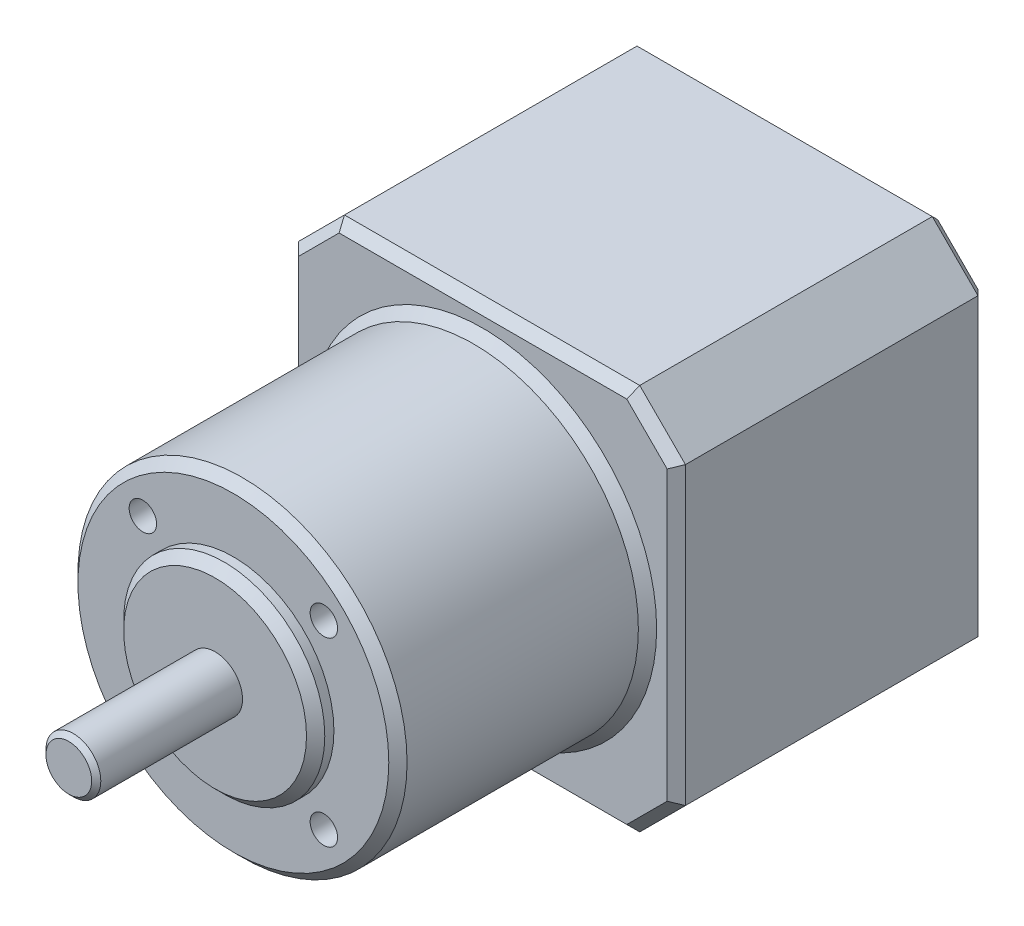
ISO-10303-21;
HEADER;
FILE_DESCRIPTION(('STEP AP214'),'2;1');
FILE_NAME('part.step','',(''),(''),'','','');
FILE_SCHEMA(('AUTOMOTIVE_DESIGN { 1 0 10303 214 1 1 1 1 }'));
ENDSEC;
DATA;
#1=APPLICATION_CONTEXT('core data for automotive mechanical design processes');
#2=APPLICATION_PROTOCOL_DEFINITION('international standard','automotive_design',2000,#1);
#3=PRODUCT_CONTEXT('',#1,'mechanical');
#4=PRODUCT('Part','Part','',(#3));
#5=PRODUCT_RELATED_PRODUCT_CATEGORY('part','',(#4));
#6=PRODUCT_DEFINITION_FORMATION('','',#4);
#7=PRODUCT_DEFINITION_CONTEXT('part definition',#1,'design');
#8=PRODUCT_DEFINITION('design','',#6,#7);
#9=PRODUCT_DEFINITION_SHAPE('','',#8);
#10=(LENGTH_UNIT() NAMED_UNIT(*) SI_UNIT(.MILLI.,.METRE.));
#11=(NAMED_UNIT(*) PLANE_ANGLE_UNIT() SI_UNIT($,.RADIAN.));
#12=(NAMED_UNIT(*) SI_UNIT($,.STERADIAN.) SOLID_ANGLE_UNIT());
#13=UNCERTAINTY_MEASURE_WITH_UNIT(LENGTH_MEASURE(1.E-05),#10,'distance_accuracy_value','');
#14=(GEOMETRIC_REPRESENTATION_CONTEXT(3) GLOBAL_UNCERTAINTY_ASSIGNED_CONTEXT((#13)) GLOBAL_UNIT_ASSIGNED_CONTEXT((#10,
#11,#12)) REPRESENTATION_CONTEXT('',''));
#15=CARTESIAN_POINT('',(0.,0.,0.));
#16=DIRECTION('',(0.,0.,1.));
#17=DIRECTION('',(1.,0.,0.));
#18=AXIS2_PLACEMENT_3D('',#15,#16,#17);
#19=CARTESIAN_POINT('',(21.15,21.15,34.));
#20=DIRECTION('',(-1.,0.,0.));
#21=DIRECTION('',(0.,0.,1.));
#22=AXIS2_PLACEMENT_3D('',#19,#20,#21);
#23=PLANE('',#22);
#24=DIRECTION('',(0.,0.,1.));
#25=VECTOR('',#24,1.);
#26=CARTESIAN_POINT('',(21.15,16.15,34.));
#27=LINE('',#26,#25);
#28=CARTESIAN_POINT('',(21.15,16.15,1.));
#29=VERTEX_POINT('',#28);
#30=CARTESIAN_POINT('',(21.15,16.15,33.));
#31=VERTEX_POINT('',#30);
#32=EDGE_CURVE('E444',#29,#31,#27,.T.);
#33=ORIENTED_EDGE('',*,*,#32,.T.);
#34=DIRECTION('',(0.,-1.,0.));
#35=VECTOR('',#34,1.);
#36=CARTESIAN_POINT('',(21.15,-16.15,33.));
#37=LINE('',#36,#35);
#38=CARTESIAN_POINT('',(21.15,-16.15,33.));
#39=VERTEX_POINT('',#38);
#40=EDGE_CURVE('E197',#31,#39,#37,.T.);
#41=ORIENTED_EDGE('',*,*,#40,.T.);
#42=DIRECTION('',(0.,0.,-1.));
#43=VECTOR('',#42,1.);
#44=CARTESIAN_POINT('',(21.15,-16.15,34.));
#45=LINE('',#44,#43);
#46=CARTESIAN_POINT('',(21.15,-16.15,1.));
#47=VERTEX_POINT('',#46);
#48=EDGE_CURVE('E421',#39,#47,#45,.T.);
#49=ORIENTED_EDGE('',*,*,#48,.T.);
#50=DIRECTION('',(0.,1.,0.));
#51=VECTOR('',#50,1.);
#52=CARTESIAN_POINT('',(21.15,21.15,1.));
#53=LINE('',#52,#51);
#54=EDGE_CURVE('E195',#47,#29,#53,.T.);
#55=ORIENTED_EDGE('',*,*,#54,.T.);
#56=EDGE_LOOP('',(#33,#41,#49,#55));
#57=FACE_BOUND('',#56,.T.);
#58=ADVANCED_FACE('F38',(#57),#23,.F.);
#59=CARTESIAN_POINT('',(-21.15,21.15,34.));
#60=DIRECTION('',(0.,-1.,0.));
#61=DIRECTION('',(0.,0.,-1.));
#62=AXIS2_PLACEMENT_3D('',#59,#60,#61);
#63=PLANE('',#62);
#64=DIRECTION('',(0.,0.,1.));
#65=VECTOR('',#64,1.);
#66=CARTESIAN_POINT('',(-16.15,21.15,34.));
#67=LINE('',#66,#65);
#68=CARTESIAN_POINT('',(-16.15,21.15,1.));
#69=VERTEX_POINT('',#68);
#70=CARTESIAN_POINT('',(-16.15,21.15,33.));
#71=VERTEX_POINT('',#70);
#72=EDGE_CURVE('E441',#69,#71,#67,.T.);
#73=ORIENTED_EDGE('',*,*,#72,.T.);
#74=DIRECTION('',(1.,0.,0.));
#75=VECTOR('',#74,1.);
#76=CARTESIAN_POINT('',(16.15,21.15,33.));
#77=LINE('',#76,#75);
#78=CARTESIAN_POINT('',(16.15,21.15,33.));
#79=VERTEX_POINT('',#78);
#80=EDGE_CURVE('E189',#71,#79,#77,.T.);
#81=ORIENTED_EDGE('',*,*,#80,.T.);
#82=DIRECTION('',(0.,0.,-1.));
#83=VECTOR('',#82,1.);
#84=CARTESIAN_POINT('',(16.15,21.15,34.));
#85=LINE('',#84,#83);
#86=CARTESIAN_POINT('',(16.15,21.15,1.));
#87=VERTEX_POINT('',#86);
#88=EDGE_CURVE('E438',#79,#87,#85,.T.);
#89=ORIENTED_EDGE('',*,*,#88,.T.);
#90=DIRECTION('',(-1.,0.,0.));
#91=VECTOR('',#90,1.);
#92=CARTESIAN_POINT('',(-21.15,21.15,1.));
#93=LINE('',#92,#91);
#94=EDGE_CURVE('E187',#87,#69,#93,.T.);
#95=ORIENTED_EDGE('',*,*,#94,.T.);
#96=EDGE_LOOP('',(#73,#81,#89,#95));
#97=FACE_BOUND('',#96,.T.);
#98=ADVANCED_FACE('F304',(#97),#63,.F.);
#99=CARTESIAN_POINT('',(-21.15,21.15,34.));
#100=DIRECTION('',(1.,0.,0.));
#101=DIRECTION('',(0.,1.,0.));
#102=AXIS2_PLACEMENT_3D('',#99,#100,#101);
#103=PLANE('',#102);
#104=DIRECTION('',(0.,0.,1.));
#105=VECTOR('',#104,1.);
#106=CARTESIAN_POINT('',(-21.15,-16.15,34.));
#107=LINE('',#106,#105);
#108=CARTESIAN_POINT('',(-21.15,-16.15,1.));
#109=VERTEX_POINT('',#108);
#110=CARTESIAN_POINT('',(-21.15,-16.15,33.));
#111=VERTEX_POINT('',#110);
#112=EDGE_CURVE('E435',#109,#111,#107,.T.);
#113=ORIENTED_EDGE('',*,*,#112,.T.);
#114=DIRECTION('',(0.,1.,0.));
#115=VECTOR('',#114,1.);
#116=CARTESIAN_POINT('',(-21.15,16.15,33.));
#117=LINE('',#116,#115);
#118=CARTESIAN_POINT('',(-21.15,16.15,33.));
#119=VERTEX_POINT('',#118);
#120=EDGE_CURVE('E214',#111,#119,#117,.T.);
#121=ORIENTED_EDGE('',*,*,#120,.T.);
#122=DIRECTION('',(0.,0.,-1.));
#123=VECTOR('',#122,1.);
#124=CARTESIAN_POINT('',(-21.15,16.15,34.));
#125=LINE('',#124,#123);
#126=CARTESIAN_POINT('',(-21.15,16.15,1.));
#127=VERTEX_POINT('',#126);
#128=EDGE_CURVE('E432',#119,#127,#125,.T.);
#129=ORIENTED_EDGE('',*,*,#128,.T.);
#130=DIRECTION('',(0.,-1.,0.));
#131=VECTOR('',#130,1.);
#132=CARTESIAN_POINT('',(-21.15,21.15,1.));
#133=LINE('',#132,#131);
#134=EDGE_CURVE('E212',#127,#109,#133,.T.);
#135=ORIENTED_EDGE('',*,*,#134,.T.);
#136=EDGE_LOOP('',(#113,#121,#129,#135));
#137=FACE_BOUND('',#136,.T.);
#138=ADVANCED_FACE('F310',(#137),#103,.F.);
#139=CARTESIAN_POINT('',(-21.15,-21.15,34.));
#140=DIRECTION('',(0.,1.,0.));
#141=DIRECTION('',(0.,0.,1.));
#142=AXIS2_PLACEMENT_3D('',#139,#140,#141);
#143=PLANE('',#142);
#144=DIRECTION('',(0.,0.,1.));
#145=VECTOR('',#144,1.);
#146=CARTESIAN_POINT('',(16.15,-21.15,34.));
#147=LINE('',#146,#145);
#148=CARTESIAN_POINT('',(16.15,-21.15,1.));
#149=VERTEX_POINT('',#148);
#150=CARTESIAN_POINT('',(16.15,-21.15,33.));
#151=VERTEX_POINT('',#150);
#152=EDGE_CURVE('E262',#149,#151,#147,.T.);
#153=ORIENTED_EDGE('',*,*,#152,.T.);
#154=DIRECTION('',(-1.,0.,0.));
#155=VECTOR('',#154,1.);
#156=CARTESIAN_POINT('',(-16.15,-21.15,33.));
#157=LINE('',#156,#155);
#158=CARTESIAN_POINT('',(-16.15,-21.15,33.));
#159=VERTEX_POINT('',#158);
#160=EDGE_CURVE('E206',#151,#159,#157,.T.);
#161=ORIENTED_EDGE('',*,*,#160,.T.);
#162=DIRECTION('',(0.,0.,-1.));
#163=VECTOR('',#162,1.);
#164=CARTESIAN_POINT('',(-16.15,-21.15,34.));
#165=LINE('',#164,#163);
#166=CARTESIAN_POINT('',(-16.15,-21.15,1.));
#167=VERTEX_POINT('',#166);
#168=EDGE_CURVE('E429',#159,#167,#165,.T.);
#169=ORIENTED_EDGE('',*,*,#168,.T.);
#170=DIRECTION('',(1.,0.,0.));
#171=VECTOR('',#170,1.);
#172=CARTESIAN_POINT('',(-21.15,-21.15,1.));
#173=LINE('',#172,#171);
#174=EDGE_CURVE('E204',#167,#149,#173,.T.);
#175=ORIENTED_EDGE('',*,*,#174,.T.);
#176=EDGE_LOOP('',(#153,#161,#169,#175));
#177=FACE_BOUND('',#176,.T.);
#178=ADVANCED_FACE('F482',(#177),#143,.F.);
#179=CARTESIAN_POINT('',(0.,0.,34.));
#180=DIRECTION('',(0.,0.,1.));
#181=DIRECTION('',(1.,0.,0.));
#182=AXIS2_PLACEMENT_3D('',#179,#180,#181);
#183=PLANE('',#182);
#184=DIRECTION('',(-1.,0.,0.));
#185=VECTOR('',#184,1.);
#186=CARTESIAN_POINT('',(-16.15,20.15,34.));
#187=LINE('',#186,#185);
#188=CARTESIAN_POINT('',(15.7357864376269,20.15,34.));
#189=VERTEX_POINT('',#188);
#190=CARTESIAN_POINT('',(-15.7357864376269,20.15,34.));
#191=VERTEX_POINT('',#190);
#192=EDGE_CURVE('E177',#189,#191,#187,.T.);
#193=ORIENTED_EDGE('',*,*,#192,.T.);
#194=DIRECTION('',(-0.707106781186549,-0.707106781186547,0.));
#195=VECTOR('',#194,1.);
#196=CARTESIAN_POINT('',(-17.9428932188134,17.9428932188135,34.));
#197=LINE('',#196,#195);
#198=CARTESIAN_POINT('',(-20.15,15.7357864376269,34.));
#199=VERTEX_POINT('',#198);
#200=EDGE_CURVE('E156',#191,#199,#197,.T.);
#201=ORIENTED_EDGE('',*,*,#200,.T.);
#202=DIRECTION('',(0.,-1.,0.));
#203=VECTOR('',#202,1.);
#204=CARTESIAN_POINT('',(-20.15,-16.15,34.));
#205=LINE('',#204,#203);
#206=CARTESIAN_POINT('',(-20.15,-15.7357864376269,34.));
#207=VERTEX_POINT('',#206);
#208=EDGE_CURVE('E165',#199,#207,#205,.T.);
#209=ORIENTED_EDGE('',*,*,#208,.T.);
#210=DIRECTION('',(0.707106781186546,-0.707106781186549,0.));
#211=VECTOR('',#210,1.);
#212=CARTESIAN_POINT('',(-17.9428932188135,-17.9428932188134,34.));
#213=LINE('',#212,#211);
#214=CARTESIAN_POINT('',(-15.7357864376269,-20.15,34.));
#215=VERTEX_POINT('',#214);
#216=EDGE_CURVE('E171',#207,#215,#213,.T.);
#217=ORIENTED_EDGE('',*,*,#216,.T.);
#218=DIRECTION('',(1.,0.,0.));
#219=VECTOR('',#218,1.);
#220=CARTESIAN_POINT('',(16.15,-20.15,34.));
#221=LINE('',#220,#219);
#222=CARTESIAN_POINT('',(15.7357864376269,-20.15,34.));
#223=VERTEX_POINT('',#222);
#224=EDGE_CURVE('E449',#215,#223,#221,.T.);
#225=ORIENTED_EDGE('',*,*,#224,.T.);
#226=DIRECTION('',(0.707106781186548,0.707106781186547,0.));
#227=VECTOR('',#226,1.);
#228=CARTESIAN_POINT('',(17.9428932188134,-17.9428932188135,34.));
#229=LINE('',#228,#227);
#230=CARTESIAN_POINT('',(20.15,-15.7357864376269,34.));
#231=VERTEX_POINT('',#230);
#232=EDGE_CURVE('E451',#223,#231,#229,.T.);
#233=ORIENTED_EDGE('',*,*,#232,.T.);
#234=DIRECTION('',(0.,1.,0.));
#235=VECTOR('',#234,1.);
#236=CARTESIAN_POINT('',(20.15,16.15,34.));
#237=LINE('',#236,#235);
#238=CARTESIAN_POINT('',(20.15,15.7357864376269,34.));
#239=VERTEX_POINT('',#238);
#240=EDGE_CURVE('E453',#231,#239,#237,.T.);
#241=ORIENTED_EDGE('',*,*,#240,.T.);
#242=DIRECTION('',(-0.707106781186547,0.707106781186549,0.));
#243=VECTOR('',#242,1.);
#244=CARTESIAN_POINT('',(17.9428932188135,17.9428932188134,34.));
#245=LINE('',#244,#243);
#246=EDGE_CURVE('E182',#239,#189,#245,.T.);
#247=ORIENTED_EDGE('',*,*,#246,.T.);
#248=EDGE_LOOP('',(#193,#201,#209,#217,#225,#233,#241,#247));
#249=FACE_BOUND('',#248,.T.);
#250=CARTESIAN_POINT('',(0.,0.,34.));
#251=DIRECTION('',(0.,0.,1.));
#252=DIRECTION('',(1.,0.,0.));
#253=AXIS2_PLACEMENT_3D('',#250,#251,#252);
#254=CIRCLE('',#253,19.);
#255=CARTESIAN_POINT('',(19.,0.,34.));
#256=VERTEX_POINT('',#255);
#257=EDGE_CURVE('E172',#256,#256,#254,.F.);
#258=ORIENTED_EDGE('',*,*,#257,.T.);
#259=EDGE_LOOP('',(#258));
#260=FACE_BOUND('',#259,.T.);
#261=ADVANCED_FACE('F174',(#249,#260),#183,.T.);
#262=CARTESIAN_POINT('',(0.,0.,0.));
#263=DIRECTION('',(0.,0.,1.));
#264=DIRECTION('',(1.,0.,0.));
#265=AXIS2_PLACEMENT_3D('',#262,#263,#264);
#266=PLANE('',#265);
#267=DIRECTION('',(0.,-1.,0.));
#268=VECTOR('',#267,1.);
#269=CARTESIAN_POINT('',(20.15,0.,0.));
#270=LINE('',#269,#268);
#271=CARTESIAN_POINT('',(20.15,15.7357864376269,0.));
#272=VERTEX_POINT('',#271);
#273=CARTESIAN_POINT('',(20.15,-15.7357864376269,0.));
#274=VERTEX_POINT('',#273);
#275=EDGE_CURVE('E53',#272,#274,#270,.T.);
#276=ORIENTED_EDGE('',*,*,#275,.T.);
#277=DIRECTION('',(-0.707106781186548,-0.707106781186547,0.));
#278=VECTOR('',#277,1.);
#279=CARTESIAN_POINT('',(15.4428932188134,-20.4428932188134,0.));
#280=LINE('',#279,#278);
#281=CARTESIAN_POINT('',(15.7357864376269,-20.15,0.));
#282=VERTEX_POINT('',#281);
#283=EDGE_CURVE('E234',#274,#282,#280,.T.);
#284=ORIENTED_EDGE('',*,*,#283,.T.);
#285=DIRECTION('',(-1.,0.,0.));
#286=VECTOR('',#285,1.);
#287=CARTESIAN_POINT('',(0.,-20.15,0.));
#288=LINE('',#287,#286);
#289=CARTESIAN_POINT('',(-15.7357864376269,-20.15,0.));
#290=VERTEX_POINT('',#289);
#291=EDGE_CURVE('E222',#282,#290,#288,.T.);
#292=ORIENTED_EDGE('',*,*,#291,.T.);
#293=DIRECTION('',(-0.707106781186546,0.707106781186549,0.));
#294=VECTOR('',#293,1.);
#295=CARTESIAN_POINT('',(-20.4428932188134,-15.4428932188134,0.));
#296=LINE('',#295,#294);
#297=CARTESIAN_POINT('',(-20.15,-15.7357864376269,0.));
#298=VERTEX_POINT('',#297);
#299=EDGE_CURVE('E224',#290,#298,#296,.T.);
#300=ORIENTED_EDGE('',*,*,#299,.T.);
#301=DIRECTION('',(0.,1.,0.));
#302=VECTOR('',#301,1.);
#303=CARTESIAN_POINT('',(-20.15,0.,0.));
#304=LINE('',#303,#302);
#305=CARTESIAN_POINT('',(-20.15,15.7357864376269,0.));
#306=VERTEX_POINT('',#305);
#307=EDGE_CURVE('E226',#298,#306,#304,.T.);
#308=ORIENTED_EDGE('',*,*,#307,.T.);
#309=DIRECTION('',(0.707106781186549,0.707106781186547,0.));
#310=VECTOR('',#309,1.);
#311=CARTESIAN_POINT('',(-15.4428932188134,20.4428932188134,0.));
#312=LINE('',#311,#310);
#313=CARTESIAN_POINT('',(-15.7357864376269,20.15,0.));
#314=VERTEX_POINT('',#313);
#315=EDGE_CURVE('E228',#306,#314,#312,.T.);
#316=ORIENTED_EDGE('',*,*,#315,.T.);
#317=DIRECTION('',(1.,0.,0.));
#318=VECTOR('',#317,1.);
#319=CARTESIAN_POINT('',(0.,20.15,0.));
#320=LINE('',#319,#318);
#321=CARTESIAN_POINT('',(15.7357864376269,20.15,0.));
#322=VERTEX_POINT('',#321);
#323=EDGE_CURVE('E230',#314,#322,#320,.T.);
#324=ORIENTED_EDGE('',*,*,#323,.T.);
#325=DIRECTION('',(0.707106781186547,-0.707106781186549,0.));
#326=VECTOR('',#325,1.);
#327=CARTESIAN_POINT('',(20.4428932188134,15.4428932188134,0.));
#328=LINE('',#327,#326);
#329=EDGE_CURVE('E58',#322,#272,#328,.T.);
#330=ORIENTED_EDGE('',*,*,#329,.T.);
#331=EDGE_LOOP('',(#276,#284,#292,#300,#308,#316,#324,#330));
#332=FACE_BOUND('',#331,.T.);
#333=ADVANCED_FACE('F320',(#332),#266,.F.);
#334=CARTESIAN_POINT('',(-16.15,-21.15,34.));
#335=DIRECTION('',(0.707106781186549,0.707106781186546,0.));
#336=DIRECTION('',(0.,0.,-1.));
#337=AXIS2_PLACEMENT_3D('',#334,#335,#336);
#338=PLANE('',#337);
#339=ORIENTED_EDGE('',*,*,#168,.F.);
#340=DIRECTION('',(0.707106781186546,-0.707106781186549,0.));
#341=VECTOR('',#340,1.);
#342=CARTESIAN_POINT('',(-16.15,-21.15,33.));
#343=LINE('',#342,#341);
#344=EDGE_CURVE('E210',#159,#111,#343,.F.);
#345=ORIENTED_EDGE('',*,*,#344,.T.);
#346=ORIENTED_EDGE('',*,*,#112,.F.);
#347=DIRECTION('',(-0.707106781186546,0.707106781186549,0.));
#348=VECTOR('',#347,1.);
#349=CARTESIAN_POINT('',(-16.15,-21.15,1.));
#350=LINE('',#349,#348);
#351=EDGE_CURVE('E208',#109,#167,#350,.F.);
#352=ORIENTED_EDGE('',*,*,#351,.T.);
#353=EDGE_LOOP('',(#339,#345,#346,#352));
#354=FACE_BOUND('',#353,.T.);
#355=ADVANCED_FACE('F316',(#354),#338,.F.);
#356=CARTESIAN_POINT('',(-21.15,16.15,34.));
#357=DIRECTION('',(0.707106781186547,-0.707106781186549,0.));
#358=DIRECTION('',(0.,0.,-1.));
#359=AXIS2_PLACEMENT_3D('',#356,#357,#358);
#360=PLANE('',#359);
#361=ORIENTED_EDGE('',*,*,#128,.F.);
#362=DIRECTION('',(-0.707106781186549,-0.707106781186547,0.));
#363=VECTOR('',#362,1.);
#364=CARTESIAN_POINT('',(-21.15,16.15,33.));
#365=LINE('',#364,#363);
#366=EDGE_CURVE('E158',#119,#71,#365,.F.);
#367=ORIENTED_EDGE('',*,*,#366,.T.);
#368=ORIENTED_EDGE('',*,*,#72,.F.);
#369=DIRECTION('',(0.707106781186549,0.707106781186547,0.));
#370=VECTOR('',#369,1.);
#371=CARTESIAN_POINT('',(-21.15,16.15,1.));
#372=LINE('',#371,#370);
#373=EDGE_CURVE('E179',#69,#127,#372,.F.);
#374=ORIENTED_EDGE('',*,*,#373,.T.);
#375=EDGE_LOOP('',(#361,#367,#368,#374));
#376=FACE_BOUND('',#375,.T.);
#377=ADVANCED_FACE('F319',(#376),#360,.F.);
#378=CARTESIAN_POINT('',(21.15,-16.15,34.));
#379=DIRECTION('',(-0.707106781186547,0.707106781186548,0.));
#380=DIRECTION('',(0.,0.,-1.));
#381=AXIS2_PLACEMENT_3D('',#378,#379,#380);
#382=PLANE('',#381);
#383=ORIENTED_EDGE('',*,*,#48,.F.);
#384=DIRECTION('',(0.707106781186548,0.707106781186547,0.));
#385=VECTOR('',#384,1.);
#386=CARTESIAN_POINT('',(21.15,-16.15,33.));
#387=LINE('',#386,#385);
#388=EDGE_CURVE('E202',#39,#151,#387,.F.);
#389=ORIENTED_EDGE('',*,*,#388,.T.);
#390=ORIENTED_EDGE('',*,*,#152,.F.);
#391=DIRECTION('',(-0.707106781186548,-0.707106781186547,0.));
#392=VECTOR('',#391,1.);
#393=CARTESIAN_POINT('',(21.15,-16.15,1.));
#394=LINE('',#393,#392);
#395=EDGE_CURVE('E199',#149,#47,#394,.F.);
#396=ORIENTED_EDGE('',*,*,#395,.T.);
#397=EDGE_LOOP('',(#383,#389,#390,#396));
#398=FACE_BOUND('',#397,.T.);
#399=ADVANCED_FACE('F324',(#398),#382,.F.);
#400=CARTESIAN_POINT('',(16.15,21.15,34.));
#401=DIRECTION('',(-0.707106781186549,-0.707106781186547,0.));
#402=DIRECTION('',(0.,0.,-1.));
#403=AXIS2_PLACEMENT_3D('',#400,#401,#402);
#404=PLANE('',#403);
#405=ORIENTED_EDGE('',*,*,#88,.F.);
#406=DIRECTION('',(-0.707106781186547,0.707106781186549,0.));
#407=VECTOR('',#406,1.);
#408=CARTESIAN_POINT('',(16.15,21.15,33.));
#409=LINE('',#408,#407);
#410=EDGE_CURVE('E193',#79,#31,#409,.F.);
#411=ORIENTED_EDGE('',*,*,#410,.T.);
#412=ORIENTED_EDGE('',*,*,#32,.F.);
#413=DIRECTION('',(0.707106781186547,-0.707106781186549,0.));
#414=VECTOR('',#413,1.);
#415=CARTESIAN_POINT('',(16.15,21.15,1.));
#416=LINE('',#415,#414);
#417=EDGE_CURVE('E191',#29,#87,#416,.F.);
#418=ORIENTED_EDGE('',*,*,#417,.T.);
#419=EDGE_LOOP('',(#405,#411,#412,#418));
#420=FACE_BOUND('',#419,.T.);
#421=ADVANCED_FACE('F328',(#420),#404,.F.);
#422=CARTESIAN_POINT('',(0.,0.,61.3));
#423=DIRECTION('',(0.,0.,-1.));
#424=DIRECTION('',(-1.,0.,0.));
#425=AXIS2_PLACEMENT_3D('',#422,#423,#424);
#426=CYLINDRICAL_SURFACE('',#425,18.);
#427=CARTESIAN_POINT('',(0.,0.,35.));
#428=DIRECTION('',(0.,0.,1.));
#429=DIRECTION('',(1.,0.,0.));
#430=AXIS2_PLACEMENT_3D('',#427,#428,#429);
#431=CIRCLE('',#430,18.);
#432=CARTESIAN_POINT('',(18.,0.,35.));
#433=VERTEX_POINT('',#432);
#434=EDGE_CURVE('E219',#433,#433,#431,.T.);
#435=ORIENTED_EDGE('',*,*,#434,.T.);
#436=EDGE_LOOP('',(#435));
#437=FACE_BOUND('',#436,.T.);
#438=CARTESIAN_POINT('',(0.,0.,60.3));
#439=DIRECTION('',(0.,0.,1.));
#440=DIRECTION('',(1.,0.,0.));
#441=AXIS2_PLACEMENT_3D('',#438,#439,#440);
#442=CIRCLE('',#441,18.);
#443=CARTESIAN_POINT('',(18.,0.,60.3));
#444=VERTEX_POINT('',#443);
#445=EDGE_CURVE('E216',#444,#444,#442,.F.);
#446=ORIENTED_EDGE('',*,*,#445,.T.);
#447=EDGE_LOOP('',(#446));
#448=FACE_BOUND('',#447,.T.);
#449=ADVANCED_FACE('F332',(#437,#448),#426,.T.);
#450=CARTESIAN_POINT('',(0.,0.,61.3));
#451=DIRECTION('',(0.,0.,1.));
#452=DIRECTION('',(1.,0.,0.));
#453=AXIS2_PLACEMENT_3D('',#450,#451,#452);
#454=PLANE('',#453);
#455=CARTESIAN_POINT('',(-9.89949493661158,9.89949493661175,61.3));
#456=DIRECTION('',(0.,0.,1.));
#457=DIRECTION('',(1.,0.,0.));
#458=AXIS2_PLACEMENT_3D('',#455,#456,#457);
#459=CIRCLE('',#458,1.5);
#460=CARTESIAN_POINT('',(-8.39949493661158,9.89949493661175,61.3));
#461=VERTEX_POINT('',#460);
#462=EDGE_CURVE('E571',#461,#461,#459,.T.);
#463=ORIENTED_EDGE('',*,*,#462,.F.);
#464=EDGE_LOOP('',(#463));
#465=FACE_BOUND('',#464,.T.);
#466=CARTESIAN_POINT('',(-9.89949493661172,-9.89949493661161,61.3));
#467=DIRECTION('',(0.,0.,1.));
#468=DIRECTION('',(1.,0.,0.));
#469=AXIS2_PLACEMENT_3D('',#466,#467,#468);
#470=CIRCLE('',#469,1.5);
#471=CARTESIAN_POINT('',(-8.39949493661172,-9.89949493661161,61.3));
#472=VERTEX_POINT('',#471);
#473=EDGE_CURVE('E565',#472,#472,#470,.T.);
#474=ORIENTED_EDGE('',*,*,#473,.F.);
#475=EDGE_LOOP('',(#474));
#476=FACE_BOUND('',#475,.T.);
#477=CARTESIAN_POINT('',(9.89949493661165,-9.89949493661168,61.3));
#478=DIRECTION('',(0.,0.,1.));
#479=DIRECTION('',(1.,0.,0.));
#480=AXIS2_PLACEMENT_3D('',#477,#478,#479);
#481=CIRCLE('',#480,1.5);
#482=CARTESIAN_POINT('',(11.3994949366116,-9.89949493661168,61.3));
#483=VERTEX_POINT('',#482);
#484=EDGE_CURVE('E556',#483,#483,#481,.T.);
#485=ORIENTED_EDGE('',*,*,#484,.F.);
#486=EDGE_LOOP('',(#485));
#487=FACE_BOUND('',#486,.T.);
#488=CARTESIAN_POINT('',(9.89949493661165,9.89949493661168,61.3));
#489=DIRECTION('',(0.,0.,1.));
#490=DIRECTION('',(1.,0.,0.));
#491=AXIS2_PLACEMENT_3D('',#488,#489,#490);
#492=CIRCLE('',#491,1.5);
#493=CARTESIAN_POINT('',(11.3994949366116,9.89949493661168,61.3));
#494=VERTEX_POINT('',#493);
#495=EDGE_CURVE('E424',#494,#494,#492,.T.);
#496=ORIENTED_EDGE('',*,*,#495,.F.);
#497=EDGE_LOOP('',(#496));
#498=FACE_BOUND('',#497,.T.);
#499=CARTESIAN_POINT('',(0.,0.,61.3));
#500=DIRECTION('',(0.,0.,1.));
#501=DIRECTION('',(1.,0.,0.));
#502=AXIS2_PLACEMENT_3D('',#499,#500,#501);
#503=CIRCLE('',#502,17.);
#504=CARTESIAN_POINT('',(17.,0.,61.3));
#505=VERTEX_POINT('',#504);
#506=EDGE_CURVE('E242',#505,#505,#503,.T.);
#507=ORIENTED_EDGE('',*,*,#506,.T.);
#508=EDGE_LOOP('',(#507));
#509=FACE_BOUND('',#508,.T.);
#510=CARTESIAN_POINT('',(0.,0.,61.3));
#511=DIRECTION('',(0.,0.,1.));
#512=DIRECTION('',(1.,0.,0.));
#513=AXIS2_PLACEMENT_3D('',#510,#511,#512);
#514=CIRCLE('',#513,11.);
#515=CARTESIAN_POINT('',(11.,0.,61.3));
#516=VERTEX_POINT('',#515);
#517=EDGE_CURVE('E416',#516,#516,#514,.T.);
#518=ORIENTED_EDGE('',*,*,#517,.F.);
#519=EDGE_LOOP('',(#518));
#520=FACE_BOUND('',#519,.T.);
#521=ADVANCED_FACE('F512',(#465,#476,#487,#498,#509,#520),#454,.T.);
#522=CARTESIAN_POINT('',(0.,0.,63.3));
#523=DIRECTION('',(0.,0.,-1.));
#524=DIRECTION('',(-1.,0.,0.));
#525=AXIS2_PLACEMENT_3D('',#522,#523,#524);
#526=CYLINDRICAL_SURFACE('',#525,11.);
#527=CARTESIAN_POINT('',(0.,0.,62.3));
#528=DIRECTION('',(0.,0.,1.));
#529=DIRECTION('',(1.,0.,0.));
#530=AXIS2_PLACEMENT_3D('',#527,#528,#529);
#531=CIRCLE('',#530,11.);
#532=CARTESIAN_POINT('',(11.,0.,62.3));
#533=VERTEX_POINT('',#532);
#534=EDGE_CURVE('E239',#533,#533,#531,.F.);
#535=ORIENTED_EDGE('',*,*,#534,.T.);
#536=EDGE_LOOP('',(#535));
#537=FACE_BOUND('',#536,.T.);
#538=ORIENTED_EDGE('',*,*,#517,.T.);
#539=EDGE_LOOP('',(#538));
#540=FACE_BOUND('',#539,.T.);
#541=ADVANCED_FACE('F410',(#537,#540),#526,.T.);
#542=CARTESIAN_POINT('',(0.,0.,63.3));
#543=DIRECTION('',(0.,0.,1.));
#544=DIRECTION('',(1.,0.,0.));
#545=AXIS2_PLACEMENT_3D('',#542,#543,#544);
#546=PLANE('',#545);
#547=CARTESIAN_POINT('',(0.,0.,63.3));
#548=DIRECTION('',(0.,0.,1.));
#549=DIRECTION('',(1.,0.,0.));
#550=AXIS2_PLACEMENT_3D('',#547,#548,#549);
#551=CIRCLE('',#550,9.99999999999999);
#552=CARTESIAN_POINT('',(9.99999999999999,0.,63.3));
#553=VERTEX_POINT('',#552);
#554=EDGE_CURVE('E236',#553,#553,#551,.T.);
#555=ORIENTED_EDGE('',*,*,#554,.T.);
#556=EDGE_LOOP('',(#555));
#557=FACE_BOUND('',#556,.T.);
#558=CARTESIAN_POINT('',(0.,0.,63.3));
#559=DIRECTION('',(0.,0.,1.));
#560=DIRECTION('',(1.,0.,0.));
#561=AXIS2_PLACEMENT_3D('',#558,#559,#560);
#562=CIRCLE('',#561,3.);
#563=CARTESIAN_POINT('',(3.,0.,63.3));
#564=VERTEX_POINT('',#563);
#565=EDGE_CURVE('E414',#564,#564,#562,.T.);
#566=ORIENTED_EDGE('',*,*,#565,.F.);
#567=EDGE_LOOP('',(#566));
#568=FACE_BOUND('',#567,.T.);
#569=ADVANCED_FACE('F406',(#557,#568),#546,.T.);
#570=CARTESIAN_POINT('',(0.,0.,79.3));
#571=DIRECTION('',(0.,0.,-1.));
#572=DIRECTION('',(-1.,0.,0.));
#573=AXIS2_PLACEMENT_3D('',#570,#571,#572);
#574=CYLINDRICAL_SURFACE('',#573,3.);
#575=CARTESIAN_POINT('',(0.,0.,78.8));
#576=DIRECTION('',(0.,0.,1.));
#577=DIRECTION('',(1.,0.,0.));
#578=AXIS2_PLACEMENT_3D('',#575,#576,#577);
#579=CIRCLE('',#578,3.);
#580=CARTESIAN_POINT('',(3.,0.,78.8));
#581=VERTEX_POINT('',#580);
#582=EDGE_CURVE('E11',#581,#581,#579,.F.);
#583=ORIENTED_EDGE('',*,*,#582,.T.);
#584=EDGE_LOOP('',(#583));
#585=FACE_BOUND('',#584,.T.);
#586=ORIENTED_EDGE('',*,*,#565,.T.);
#587=EDGE_LOOP('',(#586));
#588=FACE_BOUND('',#587,.T.);
#589=ADVANCED_FACE('F409',(#585,#588),#574,.T.);
#590=CARTESIAN_POINT('',(0.,0.,79.3));
#591=DIRECTION('',(0.,0.,1.));
#592=DIRECTION('',(1.,0.,0.));
#593=AXIS2_PLACEMENT_3D('',#590,#591,#592);
#594=PLANE('',#593);
#595=CARTESIAN_POINT('',(0.,0.,79.3));
#596=DIRECTION('',(0.,0.,1.));
#597=DIRECTION('',(1.,0.,0.));
#598=AXIS2_PLACEMENT_3D('',#595,#596,#597);
#599=CIRCLE('',#598,2.5);
#600=CARTESIAN_POINT('',(2.5,0.,79.3));
#601=VERTEX_POINT('',#600);
#602=EDGE_CURVE('E46',#601,#601,#599,.T.);
#603=ORIENTED_EDGE('',*,*,#602,.T.);
#604=EDGE_LOOP('',(#603));
#605=FACE_BOUND('',#604,.T.);
#606=ADVANCED_FACE('F287',(#605),#594,.T.);
#607=CARTESIAN_POINT('',(17.9428932188134,-17.9428932188135,34.));
#608=DIRECTION('',(0.500000000000002,-0.500000000000003,0.707106781186544));
#609=DIRECTION('',(-0.707106781186548,-0.707106781186547,0.));
#610=AXIS2_PLACEMENT_3D('',#607,#608,#609);
#611=PLANE('',#610);
#612=DIRECTION('',(-0.28108463771482,0.678598344545842,0.678598344545852));
#613=VECTOR('',#612,1.);
#614=CARTESIAN_POINT('',(14.4925243973567,-17.148499920796,37.0015000792041));
#615=LINE('',#614,#613);
#616=EDGE_CURVE('E256',#151,#223,#615,.T.);
#617=ORIENTED_EDGE('',*,*,#616,.F.);
#618=ORIENTED_EDGE('',*,*,#388,.F.);
#619=DIRECTION('',(-0.678598344545842,0.281084637714821,0.678598344545852));
#620=VECTOR('',#619,1.);
#621=CARTESIAN_POINT('',(19.5546282150847,-15.4891753696607,34.5953717849153));
#622=LINE('',#621,#620);
#623=EDGE_CURVE('E259',#231,#39,#622,.F.);
#624=ORIENTED_EDGE('',*,*,#623,.F.);
#625=ORIENTED_EDGE('',*,*,#232,.F.);
#626=EDGE_LOOP('',(#617,#618,#624,#625));
#627=FACE_BOUND('',#626,.T.);
#628=ADVANCED_FACE('F358',(#627),#611,.T.);
#629=CARTESIAN_POINT('',(20.15,0.,34.));
#630=DIRECTION('',(0.707106781186552,0.,0.707106781186543));
#631=DIRECTION('',(0.,-1.,0.));
#632=AXIS2_PLACEMENT_3D('',#629,#630,#631);
#633=PLANE('',#632);
#634=ORIENTED_EDGE('',*,*,#623,.T.);
#635=ORIENTED_EDGE('',*,*,#40,.F.);
#636=DIRECTION('',(-0.678598344545843,-0.281084637714817,0.678598344545852));
#637=VECTOR('',#636,1.);
#638=CARTESIAN_POINT('',(17.148499920796,14.4925243973567,37.001500079204));
#639=LINE('',#638,#637);
#640=EDGE_CURVE('E253',#239,#31,#639,.F.);
#641=ORIENTED_EDGE('',*,*,#640,.F.);
#642=ORIENTED_EDGE('',*,*,#240,.F.);
#643=EDGE_LOOP('',(#634,#635,#641,#642));
#644=FACE_BOUND('',#643,.T.);
#645=ADVANCED_FACE('F354',(#644),#633,.T.);
#646=CARTESIAN_POINT('',(0.,-20.15,34.));
#647=DIRECTION('',(0.,-0.707106781186552,0.707106781186543));
#648=DIRECTION('',(-1.,0.,0.));
#649=AXIS2_PLACEMENT_3D('',#646,#647,#648);
#650=PLANE('',#649);
#651=ORIENTED_EDGE('',*,*,#616,.T.);
#652=ORIENTED_EDGE('',*,*,#224,.F.);
#653=DIRECTION('',(0.281084637714818,0.678598344545843,0.678598344545852));
#654=VECTOR('',#653,1.);
#655=CARTESIAN_POINT('',(-15.4891753696607,-19.5546282150847,34.5953717849153));
#656=LINE('',#655,#654);
#657=EDGE_CURVE('E250',#159,#215,#656,.T.);
#658=ORIENTED_EDGE('',*,*,#657,.F.);
#659=ORIENTED_EDGE('',*,*,#160,.F.);
#660=EDGE_LOOP('',(#651,#652,#658,#659));
#661=FACE_BOUND('',#660,.T.);
#662=ADVANCED_FACE('F350',(#661),#650,.T.);
#663=CARTESIAN_POINT('',(17.9428932188135,17.9428932188134,34.));
#664=DIRECTION('',(0.500000000000005,0.500000000000003,0.707106781186542));
#665=DIRECTION('',(0.707106781186547,-0.707106781186549,0.));
#666=AXIS2_PLACEMENT_3D('',#663,#664,#665);
#667=PLANE('',#666);
#668=ORIENTED_EDGE('',*,*,#640,.T.);
#669=ORIENTED_EDGE('',*,*,#410,.F.);
#670=DIRECTION('',(-0.281084637714818,-0.678598344545843,0.678598344545852));
#671=VECTOR('',#670,1.);
#672=CARTESIAN_POINT('',(15.4891753696607,19.5546282150847,34.5953717849153));
#673=LINE('',#672,#671);
#674=EDGE_CURVE('E247',#189,#79,#673,.F.);
#675=ORIENTED_EDGE('',*,*,#674,.F.);
#676=ORIENTED_EDGE('',*,*,#246,.F.);
#677=EDGE_LOOP('',(#668,#669,#675,#676));
#678=FACE_BOUND('',#677,.T.);
#679=ADVANCED_FACE('F346',(#678),#667,.T.);
#680=CARTESIAN_POINT('',(-17.9428932188135,-17.9428932188134,34.));
#681=DIRECTION('',(-0.500000000000005,-0.500000000000003,0.707106781186542));
#682=DIRECTION('',(-0.707106781186546,0.707106781186549,0.));
#683=AXIS2_PLACEMENT_3D('',#680,#681,#682);
#684=PLANE('',#683);
#685=ORIENTED_EDGE('',*,*,#657,.T.);
#686=ORIENTED_EDGE('',*,*,#216,.F.);
#687=DIRECTION('',(0.678598344545842,0.281084637714818,0.678598344545853));
#688=VECTOR('',#687,1.);
#689=CARTESIAN_POINT('',(-17.148499920796,-14.4925243973567,37.001500079204));
#690=LINE('',#689,#688);
#691=EDGE_CURVE('E168',#111,#207,#690,.T.);
#692=ORIENTED_EDGE('',*,*,#691,.F.);
#693=ORIENTED_EDGE('',*,*,#344,.F.);
#694=EDGE_LOOP('',(#685,#686,#692,#693));
#695=FACE_BOUND('',#694,.T.);
#696=ADVANCED_FACE('F342',(#695),#684,.T.);
#697=CARTESIAN_POINT('',(0.,20.15,34.));
#698=DIRECTION('',(0.,0.707106781186552,0.707106781186543));
#699=DIRECTION('',(1.,0.,0.));
#700=AXIS2_PLACEMENT_3D('',#697,#698,#699);
#701=PLANE('',#700);
#702=ORIENTED_EDGE('',*,*,#674,.T.);
#703=ORIENTED_EDGE('',*,*,#80,.F.);
#704=DIRECTION('',(0.281084637714812,-0.678598344545844,0.678598344545853));
#705=VECTOR('',#704,1.);
#706=CARTESIAN_POINT('',(-14.4925243973567,17.148499920796,37.001500079204));
#707=LINE('',#706,#705);
#708=EDGE_CURVE('E161',#191,#71,#707,.F.);
#709=ORIENTED_EDGE('',*,*,#708,.F.);
#710=ORIENTED_EDGE('',*,*,#192,.F.);
#711=EDGE_LOOP('',(#702,#703,#709,#710));
#712=FACE_BOUND('',#711,.T.);
#713=ADVANCED_FACE('F339',(#712),#701,.T.);
#714=CARTESIAN_POINT('',(-20.15,0.,34.));
#715=DIRECTION('',(-0.707106781186553,0.,0.707106781186542));
#716=DIRECTION('',(0.,1.,0.));
#717=AXIS2_PLACEMENT_3D('',#714,#715,#716);
#718=PLANE('',#717);
#719=ORIENTED_EDGE('',*,*,#691,.T.);
#720=ORIENTED_EDGE('',*,*,#208,.F.);
#721=DIRECTION('',(-0.678598344545843,0.281084637714815,-0.678598344545853));
#722=VECTOR('',#721,1.);
#723=CARTESIAN_POINT('',(-17.148499920796,14.4925243973567,37.001500079204));
#724=LINE('',#723,#722);
#725=EDGE_CURVE('E152',#119,#199,#724,.F.);
#726=ORIENTED_EDGE('',*,*,#725,.F.);
#727=ORIENTED_EDGE('',*,*,#120,.F.);
#728=EDGE_LOOP('',(#719,#720,#726,#727));
#729=FACE_BOUND('',#728,.T.);
#730=ADVANCED_FACE('F166',(#729),#718,.T.);
#731=CARTESIAN_POINT('',(-17.9428932188134,17.9428932188135,34.));
#732=DIRECTION('',(-0.500000000000004,0.500000000000006,0.70710678118654));
#733=DIRECTION('',(0.707106781186549,0.707106781186547,0.));
#734=AXIS2_PLACEMENT_3D('',#731,#732,#733);
#735=PLANE('',#734);
#736=ORIENTED_EDGE('',*,*,#708,.T.);
#737=ORIENTED_EDGE('',*,*,#366,.F.);
#738=ORIENTED_EDGE('',*,*,#725,.T.);
#739=ORIENTED_EDGE('',*,*,#200,.F.);
#740=EDGE_LOOP('',(#736,#737,#738,#739));
#741=FACE_BOUND('',#740,.T.);
#742=ADVANCED_FACE('F154',(#741),#735,.T.);
#743=CARTESIAN_POINT('',(0.,0.,35.));
#744=DIRECTION('',(0.,0.,-1.));
#745=DIRECTION('',(-1.,0.,0.));
#746=AXIS2_PLACEMENT_3D('',#743,#744,#745);
#747=CONICAL_SURFACE('',#746,18.,0.785398163397436);
#748=ORIENTED_EDGE('',*,*,#257,.F.);
#749=EDGE_LOOP('',(#748));
#750=FACE_BOUND('',#749,.T.);
#751=ORIENTED_EDGE('',*,*,#434,.F.);
#752=EDGE_LOOP('',(#751));
#753=FACE_BOUND('',#752,.T.);
#754=ADVANCED_FACE('F336',(#750,#753),#747,.T.);
#755=CARTESIAN_POINT('',(-17.9428932188134,17.9428932188135,0.));
#756=DIRECTION('',(0.499999999999997,-0.499999999999999,0.70710678118655));
#757=DIRECTION('',(0.707106781186549,0.707106781186547,0.));
#758=AXIS2_PLACEMENT_3D('',#755,#756,#757);
#759=PLANE('',#758);
#760=DIRECTION('',(0.678598344545852,-0.281084637714818,-0.678598344545843));
#761=VECTOR('',#760,1.);
#762=CARTESIAN_POINT('',(-22.1037178491527,16.5450428677964,1.95371784915272));
#763=LINE('',#762,#761);
#764=EDGE_CURVE('E280',#127,#306,#763,.T.);
#765=ORIENTED_EDGE('',*,*,#764,.F.);
#766=ORIENTED_EDGE('',*,*,#373,.F.);
#767=DIRECTION('',(0.281084637714816,-0.678598344545853,-0.678598344545843));
#768=VECTOR('',#767,1.);
#769=CARTESIAN_POINT('',(-15.4891753696607,19.5546282150847,-0.595371784915277));
#770=LINE('',#769,#768);
#771=EDGE_CURVE('E162',#314,#69,#770,.F.);
#772=ORIENTED_EDGE('',*,*,#771,.F.);
#773=ORIENTED_EDGE('',*,*,#315,.F.);
#774=EDGE_LOOP('',(#765,#766,#772,#773));
#775=FACE_BOUND('',#774,.T.);
#776=ADVANCED_FACE('F365',(#775),#759,.F.);
#777=CARTESIAN_POINT('',(-21.15,21.15,1.));
#778=DIRECTION('',(0.,-0.707106781186542,0.707106781186552));
#779=DIRECTION('',(-1.,0.,0.));
#780=AXIS2_PLACEMENT_3D('',#777,#778,#779);
#781=PLANE('',#780);
#782=ORIENTED_EDGE('',*,*,#771,.T.);
#783=ORIENTED_EDGE('',*,*,#94,.F.);
#784=DIRECTION('',(-0.281084637714822,-0.678598344545852,-0.678598344545842));
#785=VECTOR('',#784,1.);
#786=CARTESIAN_POINT('',(13.2029802062391,14.0352648453206,-6.11473515467935));
#787=LINE('',#786,#785);
#788=EDGE_CURVE('E277',#322,#87,#787,.F.);
#789=ORIENTED_EDGE('',*,*,#788,.F.);
#790=ORIENTED_EDGE('',*,*,#323,.F.);
#791=EDGE_LOOP('',(#782,#783,#789,#790));
#792=FACE_BOUND('',#791,.T.);
#793=ADVANCED_FACE('F390',(#792),#781,.F.);
#794=CARTESIAN_POINT('',(-21.15,21.15,1.));
#795=DIRECTION('',(0.707106781186543,0.,0.707106781186552));
#796=DIRECTION('',(0.,-1.,0.));
#797=AXIS2_PLACEMENT_3D('',#794,#795,#796);
#798=PLANE('',#797);
#799=ORIENTED_EDGE('',*,*,#764,.T.);
#800=ORIENTED_EDGE('',*,*,#307,.F.);
#801=DIRECTION('',(0.678598344545851,0.281084637714821,-0.678598344545843));
#802=VECTOR('',#801,1.);
#803=CARTESIAN_POINT('',(-19.5546282150847,-15.4891753696607,-0.595371784915263));
#804=LINE('',#803,#802);
#805=EDGE_CURVE('E274',#109,#298,#804,.T.);
#806=ORIENTED_EDGE('',*,*,#805,.F.);
#807=ORIENTED_EDGE('',*,*,#134,.F.);
#808=EDGE_LOOP('',(#799,#800,#806,#807));
#809=FACE_BOUND('',#808,.T.);
#810=ADVANCED_FACE('F386',(#809),#798,.F.);
#811=CARTESIAN_POINT('',(17.9428932188135,17.9428932188134,0.));
#812=DIRECTION('',(-0.499999999999998,-0.499999999999996,0.707106781186552));
#813=DIRECTION('',(0.707106781186547,-0.707106781186549,0.));
#814=AXIS2_PLACEMENT_3D('',#811,#812,#813);
#815=PLANE('',#814);
#816=ORIENTED_EDGE('',*,*,#788,.T.);
#817=ORIENTED_EDGE('',*,*,#417,.F.);
#818=DIRECTION('',(-0.678598344545852,-0.28108463771482,-0.678598344545842));
#819=VECTOR('',#818,1.);
#820=CARTESIAN_POINT('',(19.5546282150847,15.4891753696607,-0.595371784915268));
#821=LINE('',#820,#819);
#822=EDGE_CURVE('E271',#272,#29,#821,.F.);
#823=ORIENTED_EDGE('',*,*,#822,.F.);
#824=ORIENTED_EDGE('',*,*,#329,.F.);
#825=EDGE_LOOP('',(#816,#817,#823,#824));
#826=FACE_BOUND('',#825,.T.);
#827=ADVANCED_FACE('F382',(#826),#815,.F.);
#828=CARTESIAN_POINT('',(-17.9428932188135,-17.9428932188134,0.));
#829=DIRECTION('',(0.499999999999998,0.499999999999996,0.707106781186552));
#830=DIRECTION('',(-0.707106781186546,0.707106781186549,0.));
#831=AXIS2_PLACEMENT_3D('',#828,#829,#830);
#832=PLANE('',#831);
#833=ORIENTED_EDGE('',*,*,#805,.T.);
#834=ORIENTED_EDGE('',*,*,#299,.F.);
#835=DIRECTION('',(0.281084637714821,0.678598344545852,-0.678598344545842));
#836=VECTOR('',#835,1.);
#837=CARTESIAN_POINT('',(-16.5450428677964,-22.1037178491527,1.95371784915273));
#838=LINE('',#837,#836);
#839=EDGE_CURVE('E268',#167,#290,#838,.T.);
#840=ORIENTED_EDGE('',*,*,#839,.F.);
#841=ORIENTED_EDGE('',*,*,#351,.F.);
#842=EDGE_LOOP('',(#833,#834,#840,#841));
#843=FACE_BOUND('',#842,.T.);
#844=ADVANCED_FACE('F378',(#843),#832,.F.);
#845=CARTESIAN_POINT('',(21.15,21.15,1.));
#846=DIRECTION('',(-0.707106781186542,0.,0.707106781186552));
#847=DIRECTION('',(0.,1.,0.));
#848=AXIS2_PLACEMENT_3D('',#845,#846,#847);
#849=PLANE('',#848);
#850=ORIENTED_EDGE('',*,*,#822,.T.);
#851=ORIENTED_EDGE('',*,*,#54,.F.);
#852=DIRECTION('',(-0.678598344545851,0.281084637714825,-0.678598344545841));
#853=VECTOR('',#852,1.);
#854=CARTESIAN_POINT('',(14.0352648453205,-13.2029802062391,-6.11473515467943));
#855=LINE('',#854,#853);
#856=EDGE_CURVE('E265',#274,#47,#855,.F.);
#857=ORIENTED_EDGE('',*,*,#856,.F.);
#858=ORIENTED_EDGE('',*,*,#275,.F.);
#859=EDGE_LOOP('',(#850,#851,#857,#858));
#860=FACE_BOUND('',#859,.T.);
#861=ADVANCED_FACE('F374',(#860),#849,.F.);
#862=CARTESIAN_POINT('',(-21.15,-21.15,1.));
#863=DIRECTION('',(0.,0.707106781186542,0.707106781186552));
#864=DIRECTION('',(1.,0.,0.));
#865=AXIS2_PLACEMENT_3D('',#862,#863,#864);
#866=PLANE('',#865);
#867=ORIENTED_EDGE('',*,*,#839,.T.);
#868=ORIENTED_EDGE('',*,*,#291,.F.);
#869=DIRECTION('',(0.281084637714824,-0.678598344545851,0.678598344545842));
#870=VECTOR('',#869,1.);
#871=CARTESIAN_POINT('',(13.2029802062391,-14.0352648453205,-6.11473515467941));
#872=LINE('',#871,#870);
#873=EDGE_CURVE('E263',#149,#282,#872,.F.);
#874=ORIENTED_EDGE('',*,*,#873,.F.);
#875=ORIENTED_EDGE('',*,*,#174,.F.);
#876=EDGE_LOOP('',(#867,#868,#874,#875));
#877=FACE_BOUND('',#876,.T.);
#878=ADVANCED_FACE('F370',(#877),#866,.F.);
#879=CARTESIAN_POINT('',(17.9428932188134,-17.9428932188135,0.));
#880=DIRECTION('',(-0.499999999999995,0.499999999999996,0.707106781186553));
#881=DIRECTION('',(-0.707106781186548,-0.707106781186547,0.));
#882=AXIS2_PLACEMENT_3D('',#879,#880,#881);
#883=PLANE('',#882);
#884=ORIENTED_EDGE('',*,*,#856,.T.);
#885=ORIENTED_EDGE('',*,*,#395,.F.);
#886=ORIENTED_EDGE('',*,*,#873,.T.);
#887=ORIENTED_EDGE('',*,*,#283,.F.);
#888=EDGE_LOOP('',(#884,#885,#886,#887));
#889=FACE_BOUND('',#888,.T.);
#890=ADVANCED_FACE('F367',(#889),#883,.F.);
#891=CARTESIAN_POINT('',(0.,0.,63.3));
#892=DIRECTION('',(0.,0.,-1.));
#893=DIRECTION('',(-1.,0.,0.));
#894=AXIS2_PLACEMENT_3D('',#891,#892,#893);
#895=CONICAL_SURFACE('',#894,9.99999999999999,0.785398163397443);
#896=ORIENTED_EDGE('',*,*,#534,.F.);
#897=EDGE_LOOP('',(#896));
#898=FACE_BOUND('',#897,.T.);
#899=ORIENTED_EDGE('',*,*,#554,.F.);
#900=EDGE_LOOP('',(#899));
#901=FACE_BOUND('',#900,.T.);
#902=ADVANCED_FACE('F300',(#898,#901),#895,.T.);
#903=CARTESIAN_POINT('',(0.,0.,61.3));
#904=DIRECTION('',(0.,0.,-1.));
#905=DIRECTION('',(-1.,0.,0.));
#906=AXIS2_PLACEMENT_3D('',#903,#904,#905);
#907=CONICAL_SURFACE('',#906,17.,0.785398163397447);
#908=ORIENTED_EDGE('',*,*,#445,.F.);
#909=EDGE_LOOP('',(#908));
#910=FACE_BOUND('',#909,.T.);
#911=ORIENTED_EDGE('',*,*,#506,.F.);
#912=EDGE_LOOP('',(#911));
#913=FACE_BOUND('',#912,.T.);
#914=ADVANCED_FACE('F291',(#910,#913),#907,.T.);
#915=CARTESIAN_POINT('',(0.,0.,79.3));
#916=DIRECTION('',(0.,0.,-1.));
#917=DIRECTION('',(-1.,0.,0.));
#918=AXIS2_PLACEMENT_3D('',#915,#916,#917);
#919=CONICAL_SURFACE('',#918,2.5,0.785398163397432);
#920=ORIENTED_EDGE('',*,*,#582,.F.);
#921=EDGE_LOOP('',(#920));
#922=FACE_BOUND('',#921,.T.);
#923=ORIENTED_EDGE('',*,*,#602,.F.);
#924=EDGE_LOOP('',(#923));
#925=FACE_BOUND('',#924,.T.);
#926=ADVANCED_FACE('F40',(#922,#925),#919,.T.);
#927=CARTESIAN_POINT('',(9.89949493661165,9.89949493661168,56.3));
#928=DIRECTION('',(0.,0.,1.));
#929=DIRECTION('',(1.,0.,0.));
#930=AXIS2_PLACEMENT_3D('',#927,#928,#929);
#931=CYLINDRICAL_SURFACE('',#930,1.5);
#932=CARTESIAN_POINT('',(9.89949493661165,9.89949493661168,56.3));
#933=DIRECTION('',(0.,0.,1.));
#934=DIRECTION('',(1.,0.,0.));
#935=AXIS2_PLACEMENT_3D('',#932,#933,#934);
#936=CIRCLE('',#935,1.5);
#937=CARTESIAN_POINT('',(11.3994949366116,9.89949493661168,56.3));
#938=VERTEX_POINT('',#937);
#939=EDGE_CURVE('E266',#938,#938,#936,.T.);
#940=ORIENTED_EDGE('',*,*,#939,.F.);
#941=EDGE_LOOP('',(#940));
#942=FACE_BOUND('',#941,.T.);
#943=ORIENTED_EDGE('',*,*,#495,.T.);
#944=EDGE_LOOP('',(#943));
#945=FACE_BOUND('',#944,.T.);
#946=ADVANCED_FACE('F290',(#942,#945),#931,.F.);
#947=CARTESIAN_POINT('',(9.89949493661165,9.89949493661168,56.3));
#948=DIRECTION('',(0.,0.,1.));
#949=DIRECTION('',(1.,0.,0.));
#950=AXIS2_PLACEMENT_3D('',#947,#948,#949);
#951=PLANE('',#950);
#952=ORIENTED_EDGE('',*,*,#939,.T.);
#953=EDGE_LOOP('',(#952));
#954=FACE_BOUND('',#953,.T.);
#955=ADVANCED_FACE('F297',(#954),#951,.T.);
#956=CARTESIAN_POINT('',(9.89949493661165,-9.89949493661168,56.3));
#957=DIRECTION('',(0.,0.,1.));
#958=DIRECTION('',(1.,0.,0.));
#959=AXIS2_PLACEMENT_3D('',#956,#957,#958);
#960=CYLINDRICAL_SURFACE('',#959,1.5);
#961=CARTESIAN_POINT('',(9.89949493661165,-9.89949493661168,56.3));
#962=DIRECTION('',(0.,0.,1.));
#963=DIRECTION('',(1.,0.,0.));
#964=AXIS2_PLACEMENT_3D('',#961,#962,#963);
#965=CIRCLE('',#964,1.5);
#966=CARTESIAN_POINT('',(11.3994949366116,-9.89949493661168,56.3));
#967=VERTEX_POINT('',#966);
#968=EDGE_CURVE('E555',#967,#967,#965,.T.);
#969=ORIENTED_EDGE('',*,*,#968,.F.);
#970=EDGE_LOOP('',(#969));
#971=FACE_BOUND('',#970,.T.);
#972=ORIENTED_EDGE('',*,*,#484,.T.);
#973=EDGE_LOOP('',(#972));
#974=FACE_BOUND('',#973,.T.);
#975=ADVANCED_FACE('F527',(#971,#974),#960,.F.);
#976=CARTESIAN_POINT('',(9.89949493661165,-9.89949493661168,56.3));
#977=DIRECTION('',(0.,0.,1.));
#978=DIRECTION('',(1.,0.,0.));
#979=AXIS2_PLACEMENT_3D('',#976,#977,#978);
#980=PLANE('',#979);
#981=ORIENTED_EDGE('',*,*,#968,.T.);
#982=EDGE_LOOP('',(#981));
#983=FACE_BOUND('',#982,.T.);
#984=ADVANCED_FACE('F541',(#983),#980,.T.);
#985=CARTESIAN_POINT('',(-9.89949493661172,-9.89949493661161,56.3));
#986=DIRECTION('',(0.,0.,1.));
#987=DIRECTION('',(1.,0.,0.));
#988=AXIS2_PLACEMENT_3D('',#985,#986,#987);
#989=CYLINDRICAL_SURFACE('',#988,1.5);
#990=CARTESIAN_POINT('',(-9.89949493661172,-9.89949493661161,56.3));
#991=DIRECTION('',(0.,0.,1.));
#992=DIRECTION('',(1.,0.,0.));
#993=AXIS2_PLACEMENT_3D('',#990,#991,#992);
#994=CIRCLE('',#993,1.5);
#995=CARTESIAN_POINT('',(-8.39949493661172,-9.89949493661161,56.3));
#996=VERTEX_POINT('',#995);
#997=EDGE_CURVE('E560',#996,#996,#994,.T.);
#998=ORIENTED_EDGE('',*,*,#997,.F.);
#999=EDGE_LOOP('',(#998));
#1000=FACE_BOUND('',#999,.T.);
#1001=ORIENTED_EDGE('',*,*,#473,.T.);
#1002=EDGE_LOOP('',(#1001));
#1003=FACE_BOUND('',#1002,.T.);
#1004=ADVANCED_FACE('F538',(#1000,#1003),#989,.F.);
#1005=CARTESIAN_POINT('',(-9.89949493661172,-9.89949493661161,56.3));
#1006=DIRECTION('',(0.,0.,1.));
#1007=DIRECTION('',(1.,0.,0.));
#1008=AXIS2_PLACEMENT_3D('',#1005,#1006,#1007);
#1009=PLANE('',#1008);
#1010=ORIENTED_EDGE('',*,*,#997,.T.);
#1011=EDGE_LOOP('',(#1010));
#1012=FACE_BOUND('',#1011,.T.);
#1013=ADVANCED_FACE('F533',(#1012),#1009,.T.);
#1014=CARTESIAN_POINT('',(-9.89949493661158,9.89949493661175,56.3));
#1015=DIRECTION('',(0.,0.,1.));
#1016=DIRECTION('',(1.,0.,0.));
#1017=AXIS2_PLACEMENT_3D('',#1014,#1015,#1016);
#1018=CYLINDRICAL_SURFACE('',#1017,1.5);
#1019=CARTESIAN_POINT('',(-9.89949493661158,9.89949493661175,56.3));
#1020=DIRECTION('',(0.,0.,1.));
#1021=DIRECTION('',(1.,0.,0.));
#1022=AXIS2_PLACEMENT_3D('',#1019,#1020,#1021);
#1023=CIRCLE('',#1022,1.5);
#1024=CARTESIAN_POINT('',(-8.39949493661158,9.89949493661175,56.3));
#1025=VERTEX_POINT('',#1024);
#1026=EDGE_CURVE('E568',#1025,#1025,#1023,.T.);
#1027=ORIENTED_EDGE('',*,*,#1026,.F.);
#1028=EDGE_LOOP('',(#1027));
#1029=FACE_BOUND('',#1028,.T.);
#1030=ORIENTED_EDGE('',*,*,#462,.T.);
#1031=EDGE_LOOP('',(#1030));
#1032=FACE_BOUND('',#1031,.T.);
#1033=ADVANCED_FACE('F529',(#1029,#1032),#1018,.F.);
#1034=CARTESIAN_POINT('',(-9.89949493661158,9.89949493661175,56.3));
#1035=DIRECTION('',(0.,0.,1.));
#1036=DIRECTION('',(1.,0.,0.));
#1037=AXIS2_PLACEMENT_3D('',#1034,#1035,#1036);
#1038=PLANE('',#1037);
#1039=ORIENTED_EDGE('',*,*,#1026,.T.);
#1040=EDGE_LOOP('',(#1039));
#1041=FACE_BOUND('',#1040,.T.);
#1042=ADVANCED_FACE('F532',(#1041),#1038,.T.);
#1043=CLOSED_SHELL('',(#58,#98,#138,#178,#261,#333,#355,#377,#399,#421,#449,#521,#541,#569,#589,
#606,#628,#645,#662,#679,#696,#713,#730,#742,#754,#776,#793,#810,#827,#844,#861,#878,#890,#902,
#914,#926,#946,#955,#975,#984,#1004,#1013,#1033,#1042));
#1044=MANIFOLD_SOLID_BREP('B2',#1043);
#1045=ADVANCED_BREP_SHAPE_REPRESENTATION('',(#18,#1044),#14);
#1046=SHAPE_DEFINITION_REPRESENTATION(#9,#1045);
ENDSEC;
END-ISO-10303-21;
